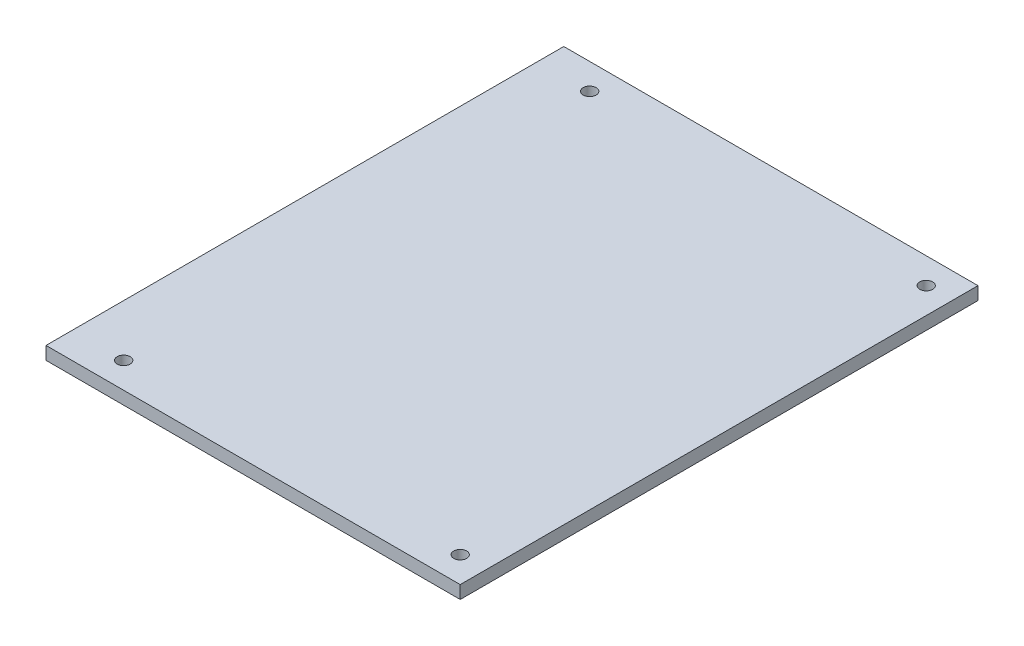
ISO-10303-21;
HEADER;
FILE_DESCRIPTION(('STEP AP214'),'2;1');
FILE_NAME('part.step','',(''),(''),'','','');
FILE_SCHEMA(('AUTOMOTIVE_DESIGN { 1 0 10303 214 1 1 1 1 }'));
ENDSEC;
DATA;
#1=APPLICATION_CONTEXT('core data for automotive mechanical design processes');
#2=APPLICATION_PROTOCOL_DEFINITION('international standard','automotive_design',2000,#1);
#3=PRODUCT_CONTEXT('',#1,'mechanical');
#4=PRODUCT('Part','Part','',(#3));
#5=PRODUCT_RELATED_PRODUCT_CATEGORY('part','',(#4));
#6=PRODUCT_DEFINITION_FORMATION('','',#4);
#7=PRODUCT_DEFINITION_CONTEXT('part definition',#1,'design');
#8=PRODUCT_DEFINITION('design','',#6,#7);
#9=PRODUCT_DEFINITION_SHAPE('','',#8);
#10=(LENGTH_UNIT() NAMED_UNIT(*) SI_UNIT(.MILLI.,.METRE.));
#11=(NAMED_UNIT(*) PLANE_ANGLE_UNIT() SI_UNIT($,.RADIAN.));
#12=(NAMED_UNIT(*) SI_UNIT($,.STERADIAN.) SOLID_ANGLE_UNIT());
#13=UNCERTAINTY_MEASURE_WITH_UNIT(LENGTH_MEASURE(1.E-05),#10,'distance_accuracy_value','');
#14=(GEOMETRIC_REPRESENTATION_CONTEXT(3) GLOBAL_UNCERTAINTY_ASSIGNED_CONTEXT((#13)) GLOBAL_UNIT_ASSIGNED_CONTEXT((#10,
#11,#12)) REPRESENTATION_CONTEXT('',''));
#15=CARTESIAN_POINT('',(0.,0.,0.));
#16=DIRECTION('',(0.,0.,1.));
#17=DIRECTION('',(1.,0.,0.));
#18=AXIS2_PLACEMENT_3D('',#15,#16,#17);
#19=CARTESIAN_POINT('',(0.,6.35,0.));
#20=DIRECTION('',(1.,0.,0.));
#21=DIRECTION('',(0.,0.,-1.));
#22=AXIS2_PLACEMENT_3D('',#19,#20,#21);
#23=PLANE('',#22);
#24=DIRECTION('',(0.,0.,1.));
#25=VECTOR('',#24,1.);
#26=CARTESIAN_POINT('',(0.,0.,0.));
#27=LINE('',#26,#25);
#28=CARTESIAN_POINT('',(0.,0.,-254.));
#29=VERTEX_POINT('',#28);
#30=CARTESIAN_POINT('',(0.,0.,0.));
#31=VERTEX_POINT('',#30);
#32=EDGE_CURVE('E99',#29,#31,#27,.T.);
#33=ORIENTED_EDGE('',*,*,#32,.T.);
#34=DIRECTION('',(0.,-1.,0.));
#35=VECTOR('',#34,1.);
#36=CARTESIAN_POINT('',(0.,6.35,0.));
#37=LINE('',#36,#35);
#38=CARTESIAN_POINT('',(0.,6.35,0.));
#39=VERTEX_POINT('',#38);
#40=EDGE_CURVE('E11',#39,#31,#37,.T.);
#41=ORIENTED_EDGE('',*,*,#40,.F.);
#42=DIRECTION('',(0.,0.,1.));
#43=VECTOR('',#42,1.);
#44=CARTESIAN_POINT('',(0.,6.35,0.));
#45=LINE('',#44,#43);
#46=CARTESIAN_POINT('',(0.,6.35,-254.));
#47=VERTEX_POINT('',#46);
#48=EDGE_CURVE('E86',#47,#39,#45,.T.);
#49=ORIENTED_EDGE('',*,*,#48,.F.);
#50=DIRECTION('',(0.,-1.,0.));
#51=VECTOR('',#50,1.);
#52=CARTESIAN_POINT('',(0.,6.35,-254.));
#53=LINE('',#52,#51);
#54=EDGE_CURVE('E95',#47,#29,#53,.T.);
#55=ORIENTED_EDGE('',*,*,#54,.T.);
#56=EDGE_LOOP('',(#33,#41,#49,#55));
#57=FACE_BOUND('',#56,.T.);
#58=ADVANCED_FACE('F33',(#57),#23,.F.);
#59=CARTESIAN_POINT('',(0.,6.35,0.));
#60=DIRECTION('',(0.,0.,-1.));
#61=DIRECTION('',(-1.,0.,0.));
#62=AXIS2_PLACEMENT_3D('',#59,#60,#61);
#63=PLANE('',#62);
#64=DIRECTION('',(1.,0.,0.));
#65=VECTOR('',#64,1.);
#66=CARTESIAN_POINT('',(0.,0.,0.));
#67=LINE('',#66,#65);
#68=CARTESIAN_POINT('',(203.2,0.,0.));
#69=VERTEX_POINT('',#68);
#70=EDGE_CURVE('E90',#31,#69,#67,.T.);
#71=ORIENTED_EDGE('',*,*,#70,.T.);
#72=DIRECTION('',(0.,-1.,0.));
#73=VECTOR('',#72,1.);
#74=CARTESIAN_POINT('',(203.2,6.35,0.));
#75=LINE('',#74,#73);
#76=CARTESIAN_POINT('',(203.2,6.35,0.));
#77=VERTEX_POINT('',#76);
#78=EDGE_CURVE('E42',#77,#69,#75,.T.);
#79=ORIENTED_EDGE('',*,*,#78,.F.);
#80=DIRECTION('',(1.,0.,0.));
#81=VECTOR('',#80,1.);
#82=CARTESIAN_POINT('',(0.,6.35,0.));
#83=LINE('',#82,#81);
#84=EDGE_CURVE('E81',#39,#77,#83,.T.);
#85=ORIENTED_EDGE('',*,*,#84,.F.);
#86=ORIENTED_EDGE('',*,*,#40,.T.);
#87=EDGE_LOOP('',(#71,#79,#85,#86));
#88=FACE_BOUND('',#87,.T.);
#89=ADVANCED_FACE('F89',(#88),#63,.F.);
#90=CARTESIAN_POINT('',(203.2,6.35,0.));
#91=DIRECTION('',(-1.,0.,0.));
#92=DIRECTION('',(0.,0.,1.));
#93=AXIS2_PLACEMENT_3D('',#90,#91,#92);
#94=PLANE('',#93);
#95=DIRECTION('',(0.,0.,-1.));
#96=VECTOR('',#95,1.);
#97=CARTESIAN_POINT('',(203.2,0.,0.));
#98=LINE('',#97,#96);
#99=CARTESIAN_POINT('',(203.2,0.,-254.));
#100=VERTEX_POINT('',#99);
#101=EDGE_CURVE('E68',#69,#100,#98,.T.);
#102=ORIENTED_EDGE('',*,*,#101,.T.);
#103=DIRECTION('',(0.,-1.,0.));
#104=VECTOR('',#103,1.);
#105=CARTESIAN_POINT('',(203.2,6.35,-254.));
#106=LINE('',#105,#104);
#107=CARTESIAN_POINT('',(203.2,6.35,-254.));
#108=VERTEX_POINT('',#107);
#109=EDGE_CURVE('E91',#108,#100,#106,.T.);
#110=ORIENTED_EDGE('',*,*,#109,.F.);
#111=DIRECTION('',(0.,0.,-1.));
#112=VECTOR('',#111,1.);
#113=CARTESIAN_POINT('',(203.2,6.35,0.));
#114=LINE('',#113,#112);
#115=EDGE_CURVE('E84',#77,#108,#114,.T.);
#116=ORIENTED_EDGE('',*,*,#115,.F.);
#117=ORIENTED_EDGE('',*,*,#78,.T.);
#118=EDGE_LOOP('',(#102,#110,#116,#117));
#119=FACE_BOUND('',#118,.T.);
#120=ADVANCED_FACE('F93',(#119),#94,.F.);
#121=CARTESIAN_POINT('',(0.,6.35,-254.));
#122=DIRECTION('',(0.,0.,1.));
#123=DIRECTION('',(1.,0.,0.));
#124=AXIS2_PLACEMENT_3D('',#121,#122,#123);
#125=PLANE('',#124);
#126=DIRECTION('',(-1.,0.,0.));
#127=VECTOR('',#126,1.);
#128=CARTESIAN_POINT('',(0.,0.,-254.));
#129=LINE('',#128,#127);
#130=EDGE_CURVE('E74',#100,#29,#129,.T.);
#131=ORIENTED_EDGE('',*,*,#130,.T.);
#132=ORIENTED_EDGE('',*,*,#54,.F.);
#133=DIRECTION('',(-1.,0.,0.));
#134=VECTOR('',#133,1.);
#135=CARTESIAN_POINT('',(0.,6.35,-254.));
#136=LINE('',#135,#134);
#137=EDGE_CURVE('E51',#108,#47,#136,.T.);
#138=ORIENTED_EDGE('',*,*,#137,.F.);
#139=ORIENTED_EDGE('',*,*,#109,.T.);
#140=EDGE_LOOP('',(#131,#132,#138,#139));
#141=FACE_BOUND('',#140,.T.);
#142=ADVANCED_FACE('F136',(#141),#125,.F.);
#143=CARTESIAN_POINT('',(0.,6.35,0.));
#144=DIRECTION('',(0.,-1.,0.));
#145=DIRECTION('',(0.,0.,-1.));
#146=AXIS2_PLACEMENT_3D('',#143,#144,#145);
#147=PLANE('',#146);
#148=CARTESIAN_POINT('',(190.5,6.35,-241.3));
#149=DIRECTION('',(0.,1.,0.));
#150=DIRECTION('',(0.,0.,1.));
#151=AXIS2_PLACEMENT_3D('',#148,#149,#150);
#152=CIRCLE('',#151,3.17499999999997);
#153=CARTESIAN_POINT('',(190.5,6.35,-238.125));
#154=VERTEX_POINT('',#153);
#155=EDGE_CURVE('E126',#154,#154,#152,.T.);
#156=ORIENTED_EDGE('',*,*,#155,.F.);
#157=EDGE_LOOP('',(#156));
#158=FACE_BOUND('',#157,.T.);
#159=CARTESIAN_POINT('',(190.5,6.35,-12.7));
#160=DIRECTION('',(0.,1.,0.));
#161=DIRECTION('',(0.,0.,1.));
#162=AXIS2_PLACEMENT_3D('',#159,#160,#161);
#163=CIRCLE('',#162,3.175);
#164=CARTESIAN_POINT('',(190.5,6.35,-9.525));
#165=VERTEX_POINT('',#164);
#166=EDGE_CURVE('E116',#165,#165,#163,.T.);
#167=ORIENTED_EDGE('',*,*,#166,.F.);
#168=EDGE_LOOP('',(#167));
#169=FACE_BOUND('',#168,.T.);
#170=CARTESIAN_POINT('',(25.4,6.35,-12.7));
#171=DIRECTION('',(0.,1.,0.));
#172=DIRECTION('',(0.,0.,1.));
#173=AXIS2_PLACEMENT_3D('',#170,#171,#172);
#174=CIRCLE('',#173,3.175);
#175=CARTESIAN_POINT('',(25.4,6.35,-9.52499999999999));
#176=VERTEX_POINT('',#175);
#177=EDGE_CURVE('E113',#176,#176,#174,.T.);
#178=ORIENTED_EDGE('',*,*,#177,.F.);
#179=EDGE_LOOP('',(#178));
#180=FACE_BOUND('',#179,.T.);
#181=CARTESIAN_POINT('',(25.4,6.35,-241.3));
#182=DIRECTION('',(0.,1.,0.));
#183=DIRECTION('',(0.,0.,1.));
#184=AXIS2_PLACEMENT_3D('',#181,#182,#183);
#185=CIRCLE('',#184,3.175);
#186=CARTESIAN_POINT('',(25.4,6.35,-238.125));
#187=VERTEX_POINT('',#186);
#188=EDGE_CURVE('E110',#187,#187,#185,.T.);
#189=ORIENTED_EDGE('',*,*,#188,.F.);
#190=EDGE_LOOP('',(#189));
#191=FACE_BOUND('',#190,.T.);
#192=ORIENTED_EDGE('',*,*,#48,.T.);
#193=ORIENTED_EDGE('',*,*,#84,.T.);
#194=ORIENTED_EDGE('',*,*,#115,.T.);
#195=ORIENTED_EDGE('',*,*,#137,.T.);
#196=EDGE_LOOP('',(#192,#193,#194,#195));
#197=FACE_BOUND('',#196,.T.);
#198=ADVANCED_FACE('F82',(#158,#169,#180,#191,#197),#147,.F.);
#199=CARTESIAN_POINT('',(0.,0.,0.));
#200=DIRECTION('',(0.,-1.,0.));
#201=DIRECTION('',(0.,0.,-1.));
#202=AXIS2_PLACEMENT_3D('',#199,#200,#201);
#203=PLANE('',#202);
#204=CARTESIAN_POINT('',(190.5,0.,-241.3));
#205=DIRECTION('',(0.,-1.,0.));
#206=DIRECTION('',(0.,0.,-1.));
#207=AXIS2_PLACEMENT_3D('',#204,#205,#206);
#208=CIRCLE('',#207,3.17499999999997);
#209=CARTESIAN_POINT('',(190.5,0.,-244.475));
#210=VERTEX_POINT('',#209);
#211=EDGE_CURVE('E36',#210,#210,#208,.T.);
#212=ORIENTED_EDGE('',*,*,#211,.F.);
#213=EDGE_LOOP('',(#212));
#214=FACE_BOUND('',#213,.T.);
#215=CARTESIAN_POINT('',(190.5,0.,-12.7));
#216=DIRECTION('',(0.,-1.,0.));
#217=DIRECTION('',(0.,0.,-1.));
#218=AXIS2_PLACEMENT_3D('',#215,#216,#217);
#219=CIRCLE('',#218,3.175);
#220=CARTESIAN_POINT('',(190.5,0.,-15.875));
#221=VERTEX_POINT('',#220);
#222=EDGE_CURVE('E114',#221,#221,#219,.T.);
#223=ORIENTED_EDGE('',*,*,#222,.F.);
#224=EDGE_LOOP('',(#223));
#225=FACE_BOUND('',#224,.T.);
#226=CARTESIAN_POINT('',(25.4,0.,-12.7));
#227=DIRECTION('',(0.,-1.,0.));
#228=DIRECTION('',(0.,0.,-1.));
#229=AXIS2_PLACEMENT_3D('',#226,#227,#228);
#230=CIRCLE('',#229,3.175);
#231=CARTESIAN_POINT('',(25.4,0.,-15.875));
#232=VERTEX_POINT('',#231);
#233=EDGE_CURVE('E111',#232,#232,#230,.T.);
#234=ORIENTED_EDGE('',*,*,#233,.F.);
#235=EDGE_LOOP('',(#234));
#236=FACE_BOUND('',#235,.T.);
#237=CARTESIAN_POINT('',(25.4,0.,-241.3));
#238=DIRECTION('',(0.,-1.,0.));
#239=DIRECTION('',(0.,0.,-1.));
#240=AXIS2_PLACEMENT_3D('',#237,#238,#239);
#241=CIRCLE('',#240,3.175);
#242=CARTESIAN_POINT('',(25.4,0.,-244.475));
#243=VERTEX_POINT('',#242);
#244=EDGE_CURVE('E102',#243,#243,#241,.T.);
#245=ORIENTED_EDGE('',*,*,#244,.F.);
#246=EDGE_LOOP('',(#245));
#247=FACE_BOUND('',#246,.T.);
#248=ORIENTED_EDGE('',*,*,#32,.F.);
#249=ORIENTED_EDGE('',*,*,#130,.F.);
#250=ORIENTED_EDGE('',*,*,#101,.F.);
#251=ORIENTED_EDGE('',*,*,#70,.F.);
#252=EDGE_LOOP('',(#248,#249,#250,#251));
#253=FACE_BOUND('',#252,.T.);
#254=ADVANCED_FACE('F135',(#214,#225,#236,#247,#253),#203,.T.);
#255=CARTESIAN_POINT('',(25.4,-19.05,-241.3));
#256=DIRECTION('',(0.,1.,0.));
#257=DIRECTION('',(0.,0.,1.));
#258=AXIS2_PLACEMENT_3D('',#255,#256,#257);
#259=CYLINDRICAL_SURFACE('',#258,3.175);
#260=ORIENTED_EDGE('',*,*,#244,.T.);
#261=EDGE_LOOP('',(#260));
#262=FACE_BOUND('',#261,.T.);
#263=ORIENTED_EDGE('',*,*,#188,.T.);
#264=EDGE_LOOP('',(#263));
#265=FACE_BOUND('',#264,.T.);
#266=ADVANCED_FACE('F132',(#262,#265),#259,.F.);
#267=CARTESIAN_POINT('',(25.4,-19.05,-12.7));
#268=DIRECTION('',(0.,1.,0.));
#269=DIRECTION('',(0.,0.,1.));
#270=AXIS2_PLACEMENT_3D('',#267,#268,#269);
#271=CYLINDRICAL_SURFACE('',#270,3.175);
#272=ORIENTED_EDGE('',*,*,#233,.T.);
#273=EDGE_LOOP('',(#272));
#274=FACE_BOUND('',#273,.T.);
#275=ORIENTED_EDGE('',*,*,#177,.T.);
#276=EDGE_LOOP('',(#275));
#277=FACE_BOUND('',#276,.T.);
#278=ADVANCED_FACE('F185',(#274,#277),#271,.F.);
#279=CARTESIAN_POINT('',(190.5,-19.05,-12.7));
#280=DIRECTION('',(0.,1.,0.));
#281=DIRECTION('',(0.,0.,1.));
#282=AXIS2_PLACEMENT_3D('',#279,#280,#281);
#283=CYLINDRICAL_SURFACE('',#282,3.175);
#284=ORIENTED_EDGE('',*,*,#222,.T.);
#285=EDGE_LOOP('',(#284));
#286=FACE_BOUND('',#285,.T.);
#287=ORIENTED_EDGE('',*,*,#166,.T.);
#288=EDGE_LOOP('',(#287));
#289=FACE_BOUND('',#288,.T.);
#290=ADVANCED_FACE('F194',(#286,#289),#283,.F.);
#291=CARTESIAN_POINT('',(190.5,-19.05,-241.3));
#292=DIRECTION('',(0.,1.,0.));
#293=DIRECTION('',(0.,0.,1.));
#294=AXIS2_PLACEMENT_3D('',#291,#292,#293);
#295=CYLINDRICAL_SURFACE('',#294,3.17499999999997);
#296=ORIENTED_EDGE('',*,*,#211,.T.);
#297=EDGE_LOOP('',(#296));
#298=FACE_BOUND('',#297,.T.);
#299=ORIENTED_EDGE('',*,*,#155,.T.);
#300=EDGE_LOOP('',(#299));
#301=FACE_BOUND('',#300,.T.);
#302=ADVANCED_FACE('F204',(#298,#301),#295,.F.);
#303=CLOSED_SHELL('',(#58,#89,#120,#142,#198,#254,#266,#278,#290,#302));
#304=MANIFOLD_SOLID_BREP('B2',#303);
#305=ADVANCED_BREP_SHAPE_REPRESENTATION('',(#18,#304),#14);
#306=SHAPE_DEFINITION_REPRESENTATION(#9,#305);
ENDSEC;
END-ISO-10303-21;
